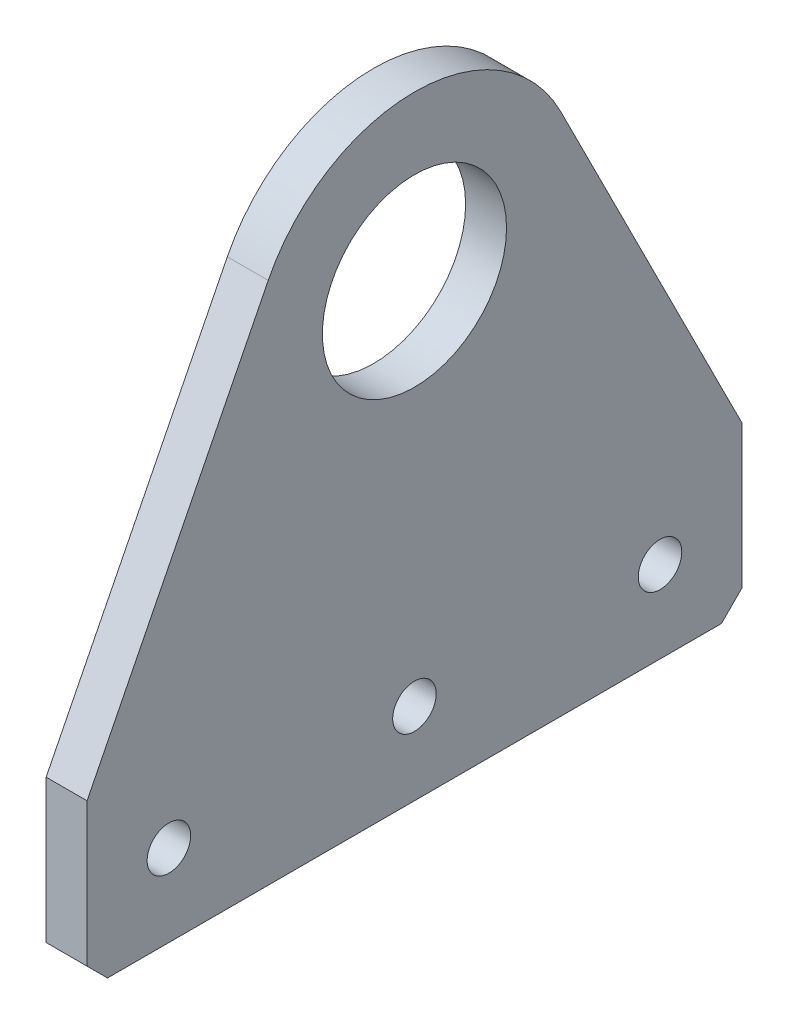
ISO-10303-21;
HEADER;
FILE_DESCRIPTION(('STEP AP214'),'2;1');
FILE_NAME('part.step','',(''),(''),'','','');
FILE_SCHEMA(('AUTOMOTIVE_DESIGN { 1 0 10303 214 1 1 1 1 }'));
ENDSEC;
DATA;
#1=APPLICATION_CONTEXT('core data for automotive mechanical design processes');
#2=APPLICATION_PROTOCOL_DEFINITION('international standard','automotive_design',2000,#1);
#3=PRODUCT_CONTEXT('',#1,'mechanical');
#4=PRODUCT('Part','Part','',(#3));
#5=PRODUCT_RELATED_PRODUCT_CATEGORY('part','',(#4));
#6=PRODUCT_DEFINITION_FORMATION('','',#4);
#7=PRODUCT_DEFINITION_CONTEXT('part definition',#1,'design');
#8=PRODUCT_DEFINITION('design','',#6,#7);
#9=PRODUCT_DEFINITION_SHAPE('','',#8);
#10=(LENGTH_UNIT() NAMED_UNIT(*) SI_UNIT(.MILLI.,.METRE.));
#11=(NAMED_UNIT(*) PLANE_ANGLE_UNIT() SI_UNIT($,.RADIAN.));
#12=(NAMED_UNIT(*) SI_UNIT($,.STERADIAN.) SOLID_ANGLE_UNIT());
#13=UNCERTAINTY_MEASURE_WITH_UNIT(LENGTH_MEASURE(1.E-05),#10,'distance_accuracy_value','');
#14=(GEOMETRIC_REPRESENTATION_CONTEXT(3) GLOBAL_UNCERTAINTY_ASSIGNED_CONTEXT((#13)) GLOBAL_UNIT_ASSIGNED_CONTEXT((#10,
#11,#12)) REPRESENTATION_CONTEXT('',''));
#15=CARTESIAN_POINT('',(0.,0.,0.));
#16=DIRECTION('',(0.,0.,1.));
#17=DIRECTION('',(1.,0.,0.));
#18=AXIS2_PLACEMENT_3D('',#15,#16,#17);
#19=CARTESIAN_POINT('',(6.35,69.85,-50.8));
#20=DIRECTION('',(-1.,0.,0.));
#21=DIRECTION('',(0.,0.,1.));
#22=AXIS2_PLACEMENT_3D('',#19,#20,#21);
#23=PLANE('',#22);
#24=CARTESIAN_POINT('',(6.35,12.7,-12.7));
#25=DIRECTION('',(1.,0.,0.));
#26=DIRECTION('',(0.,0.,-1.));
#27=AXIS2_PLACEMENT_3D('',#24,#25,#26);
#28=CIRCLE('',#27,3.3782);
#29=CARTESIAN_POINT('',(6.35,12.7,-16.0782));
#30=VERTEX_POINT('',#29);
#31=EDGE_CURVE('E306',#30,#30,#28,.T.);
#32=ORIENTED_EDGE('',*,*,#31,.F.);
#33=EDGE_LOOP('',(#32));
#34=FACE_BOUND('',#33,.T.);
#35=CARTESIAN_POINT('',(6.35,12.7,-50.8));
#36=DIRECTION('',(1.,0.,0.));
#37=DIRECTION('',(0.,0.,-1.));
#38=AXIS2_PLACEMENT_3D('',#35,#36,#37);
#39=CIRCLE('',#38,3.3782);
#40=CARTESIAN_POINT('',(6.35,12.7,-54.1782));
#41=VERTEX_POINT('',#40);
#42=EDGE_CURVE('E208',#41,#41,#39,.T.);
#43=ORIENTED_EDGE('',*,*,#42,.F.);
#44=EDGE_LOOP('',(#43));
#45=FACE_BOUND('',#44,.T.);
#46=CARTESIAN_POINT('',(6.35,12.7,-88.9));
#47=DIRECTION('',(1.,0.,0.));
#48=DIRECTION('',(0.,0.,-1.));
#49=AXIS2_PLACEMENT_3D('',#46,#47,#48);
#50=CIRCLE('',#49,3.37819999999999);
#51=CARTESIAN_POINT('',(6.35,12.7,-92.2782));
#52=VERTEX_POINT('',#51);
#53=EDGE_CURVE('E202',#52,#52,#50,.T.);
#54=ORIENTED_EDGE('',*,*,#53,.F.);
#55=EDGE_LOOP('',(#54));
#56=FACE_BOUND('',#55,.T.);
#57=DIRECTION('',(0.,0.,-1.));
#58=VECTOR('',#57,1.);
#59=CARTESIAN_POINT('',(6.35,0.,-101.6));
#60=LINE('',#59,#58);
#61=CARTESIAN_POINT('',(6.35,0.,-3.17500000000001));
#62=VERTEX_POINT('',#61);
#63=CARTESIAN_POINT('',(6.35,0.,-98.425));
#64=VERTEX_POINT('',#63);
#65=EDGE_CURVE('E128',#62,#64,#60,.T.);
#66=ORIENTED_EDGE('',*,*,#65,.T.);
#67=DIRECTION('',(0.,-0.707106781186548,0.707106781186548));
#68=VECTOR('',#67,1.);
#69=CARTESIAN_POINT('',(6.35,3.17500000000001,-101.6));
#70=LINE('',#69,#68);
#71=CARTESIAN_POINT('',(6.35,3.17500000000001,-101.6));
#72=VERTEX_POINT('',#71);
#73=EDGE_CURVE('E59',#64,#72,#70,.F.);
#74=ORIENTED_EDGE('',*,*,#73,.T.);
#75=DIRECTION('',(0.,1.,0.));
#76=VECTOR('',#75,1.);
#77=CARTESIAN_POINT('',(6.35,25.4,-101.6));
#78=LINE('',#77,#76);
#79=CARTESIAN_POINT('',(6.35,25.4,-101.6));
#80=VERTEX_POINT('',#79);
#81=EDGE_CURVE('E117',#72,#80,#78,.T.);
#82=ORIENTED_EDGE('',*,*,#81,.T.);
#83=DIRECTION('',(0.,0.893292076217458,0.449476658534237));
#84=VECTOR('',#83,1.);
#85=CARTESIAN_POINT('',(6.35,81.2667071267696,-73.4896187359234));
#86=LINE('',#85,#84);
#87=CARTESIAN_POINT('',(6.35,81.2667071267696,-73.4896187359234));
#88=VERTEX_POINT('',#87);
#89=EDGE_CURVE('E121',#80,#88,#86,.T.);
#90=ORIENTED_EDGE('',*,*,#89,.T.);
#91=CARTESIAN_POINT('',(6.35,69.85,-50.8));
#92=DIRECTION('',(1.,0.,0.));
#93=DIRECTION('',(0.,0.,1.));
#94=AXIS2_PLACEMENT_3D('',#91,#92,#93);
#95=CIRCLE('',#94,25.4);
#96=CARTESIAN_POINT('',(6.35,81.2667071267696,-28.1103812640766));
#97=VERTEX_POINT('',#96);
#98=EDGE_CURVE('E144',#88,#97,#95,.T.);
#99=ORIENTED_EDGE('',*,*,#98,.T.);
#100=DIRECTION('',(0.,-0.893292076217458,0.449476658534238));
#101=VECTOR('',#100,1.);
#102=CARTESIAN_POINT('',(6.35,25.4,0.));
#103=LINE('',#102,#101);
#104=CARTESIAN_POINT('',(6.35,25.4,0.));
#105=VERTEX_POINT('',#104);
#106=EDGE_CURVE('E148',#97,#105,#103,.T.);
#107=ORIENTED_EDGE('',*,*,#106,.T.);
#108=DIRECTION('',(0.,-1.,0.));
#109=VECTOR('',#108,1.);
#110=CARTESIAN_POINT('',(6.35,0.,0.));
#111=LINE('',#110,#109);
#112=CARTESIAN_POINT('',(6.35,3.17500000000001,0.));
#113=VERTEX_POINT('',#112);
#114=EDGE_CURVE('E154',#105,#113,#111,.T.);
#115=ORIENTED_EDGE('',*,*,#114,.T.);
#116=DIRECTION('',(0.,0.707106781186548,0.707106781186548));
#117=VECTOR('',#116,1.);
#118=CARTESIAN_POINT('',(6.35,0.,-3.17500000000001));
#119=LINE('',#118,#117);
#120=EDGE_CURVE('E186',#113,#62,#119,.F.);
#121=ORIENTED_EDGE('',*,*,#120,.T.);
#122=EDGE_LOOP('',(#66,#74,#82,#90,#99,#107,#115,#121));
#123=FACE_BOUND('',#122,.T.);
#124=CARTESIAN_POINT('',(6.35,69.85,-50.8));
#125=DIRECTION('',(1.,0.,0.));
#126=DIRECTION('',(0.,0.,-1.));
#127=AXIS2_PLACEMENT_3D('',#124,#125,#126);
#128=CIRCLE('',#127,14.2875);
#129=CARTESIAN_POINT('',(6.35,69.85,-65.0875));
#130=VERTEX_POINT('',#129);
#131=EDGE_CURVE('E161',#130,#130,#128,.T.);
#132=ORIENTED_EDGE('',*,*,#131,.F.);
#133=EDGE_LOOP('',(#132));
#134=FACE_BOUND('',#133,.T.);
#135=ADVANCED_FACE('F50',(#34,#45,#56,#123,#134),#23,.F.);
#136=CARTESIAN_POINT('',(0.,69.85,-50.8));
#137=DIRECTION('',(-1.,0.,0.));
#138=DIRECTION('',(0.,0.,1.));
#139=AXIS2_PLACEMENT_3D('',#136,#137,#138);
#140=PLANE('',#139);
#141=CARTESIAN_POINT('',(0.,12.7,-12.7));
#142=DIRECTION('',(1.,0.,0.));
#143=DIRECTION('',(0.,0.,-1.));
#144=AXIS2_PLACEMENT_3D('',#141,#142,#143);
#145=CIRCLE('',#144,3.3782);
#146=CARTESIAN_POINT('',(0.,12.7,-16.0782));
#147=VERTEX_POINT('',#146);
#148=EDGE_CURVE('E197',#147,#147,#145,.T.);
#149=ORIENTED_EDGE('',*,*,#148,.T.);
#150=EDGE_LOOP('',(#149));
#151=FACE_BOUND('',#150,.T.);
#152=CARTESIAN_POINT('',(0.,12.7,-50.8));
#153=DIRECTION('',(1.,0.,0.));
#154=DIRECTION('',(0.,0.,-1.));
#155=AXIS2_PLACEMENT_3D('',#152,#153,#154);
#156=CIRCLE('',#155,3.3782);
#157=CARTESIAN_POINT('',(0.,12.7,-54.1782));
#158=VERTEX_POINT('',#157);
#159=EDGE_CURVE('E213',#158,#158,#156,.T.);
#160=ORIENTED_EDGE('',*,*,#159,.T.);
#161=EDGE_LOOP('',(#160));
#162=FACE_BOUND('',#161,.T.);
#163=CARTESIAN_POINT('',(0.,12.7,-88.9));
#164=DIRECTION('',(1.,0.,0.));
#165=DIRECTION('',(0.,0.,-1.));
#166=AXIS2_PLACEMENT_3D('',#163,#164,#165);
#167=CIRCLE('',#166,3.37819999999999);
#168=CARTESIAN_POINT('',(0.,12.7,-92.2782));
#169=VERTEX_POINT('',#168);
#170=EDGE_CURVE('E214',#169,#169,#167,.T.);
#171=ORIENTED_EDGE('',*,*,#170,.T.);
#172=EDGE_LOOP('',(#171));
#173=FACE_BOUND('',#172,.T.);
#174=DIRECTION('',(0.,1.,0.));
#175=VECTOR('',#174,1.);
#176=CARTESIAN_POINT('',(0.,25.4,-101.6));
#177=LINE('',#176,#175);
#178=CARTESIAN_POINT('',(0.,3.17500000000001,-101.6));
#179=VERTEX_POINT('',#178);
#180=CARTESIAN_POINT('',(0.,25.4,-101.6));
#181=VERTEX_POINT('',#180);
#182=EDGE_CURVE('E134',#179,#181,#177,.T.);
#183=ORIENTED_EDGE('',*,*,#182,.F.);
#184=DIRECTION('',(0.,0.707106781186548,-0.707106781186548));
#185=VECTOR('',#184,1.);
#186=CARTESIAN_POINT('',(0.,11.1125,-109.5375));
#187=LINE('',#186,#185);
#188=CARTESIAN_POINT('',(0.,0.,-98.425));
#189=VERTEX_POINT('',#188);
#190=EDGE_CURVE('E180',#179,#189,#187,.F.);
#191=ORIENTED_EDGE('',*,*,#190,.T.);
#192=DIRECTION('',(0.,0.,-1.));
#193=VECTOR('',#192,1.);
#194=CARTESIAN_POINT('',(0.,0.,-101.6));
#195=LINE('',#194,#193);
#196=CARTESIAN_POINT('',(0.,0.,-3.17500000000001));
#197=VERTEX_POINT('',#196);
#198=EDGE_CURVE('E158',#197,#189,#195,.T.);
#199=ORIENTED_EDGE('',*,*,#198,.F.);
#200=DIRECTION('',(0.,-0.707106781186548,-0.707106781186548));
#201=VECTOR('',#200,1.);
#202=CARTESIAN_POINT('',(0.,11.1125,7.93749999999998));
#203=LINE('',#202,#201);
#204=CARTESIAN_POINT('',(0.,3.17500000000001,0.));
#205=VERTEX_POINT('',#204);
#206=EDGE_CURVE('E178',#197,#205,#203,.F.);
#207=ORIENTED_EDGE('',*,*,#206,.T.);
#208=DIRECTION('',(0.,-1.,0.));
#209=VECTOR('',#208,1.);
#210=CARTESIAN_POINT('',(0.,0.,0.));
#211=LINE('',#210,#209);
#212=CARTESIAN_POINT('',(0.,25.4,0.));
#213=VERTEX_POINT('',#212);
#214=EDGE_CURVE('E169',#213,#205,#211,.T.);
#215=ORIENTED_EDGE('',*,*,#214,.F.);
#216=DIRECTION('',(0.,-0.893292076217458,0.449476658534238));
#217=VECTOR('',#216,1.);
#218=CARTESIAN_POINT('',(0.,25.4,0.));
#219=LINE('',#218,#217);
#220=CARTESIAN_POINT('',(0.,81.2667071267696,-28.1103812640766));
#221=VERTEX_POINT('',#220);
#222=EDGE_CURVE('E167',#221,#213,#219,.T.);
#223=ORIENTED_EDGE('',*,*,#222,.F.);
#224=CARTESIAN_POINT('',(0.,69.85,-50.8));
#225=DIRECTION('',(1.,0.,0.));
#226=DIRECTION('',(0.,0.,1.));
#227=AXIS2_PLACEMENT_3D('',#224,#225,#226);
#228=CIRCLE('',#227,25.4);
#229=CARTESIAN_POINT('',(0.,81.2667071267696,-73.4896187359234));
#230=VERTEX_POINT('',#229);
#231=EDGE_CURVE('E165',#230,#221,#228,.T.);
#232=ORIENTED_EDGE('',*,*,#231,.F.);
#233=DIRECTION('',(0.,0.893292076217458,0.449476658534237));
#234=VECTOR('',#233,1.);
#235=CARTESIAN_POINT('',(0.,81.2667071267696,-73.4896187359234));
#236=LINE('',#235,#234);
#237=EDGE_CURVE('E163',#181,#230,#236,.T.);
#238=ORIENTED_EDGE('',*,*,#237,.F.);
#239=EDGE_LOOP('',(#183,#191,#199,#207,#215,#223,#232,#238));
#240=FACE_BOUND('',#239,.T.);
#241=CARTESIAN_POINT('',(0.,69.85,-50.8));
#242=DIRECTION('',(1.,0.,0.));
#243=DIRECTION('',(0.,0.,-1.));
#244=AXIS2_PLACEMENT_3D('',#241,#242,#243);
#245=CIRCLE('',#244,14.2875);
#246=CARTESIAN_POINT('',(0.,69.85,-65.0875));
#247=VERTEX_POINT('',#246);
#248=EDGE_CURVE('E194',#247,#247,#245,.T.);
#249=ORIENTED_EDGE('',*,*,#248,.T.);
#250=EDGE_LOOP('',(#249));
#251=FACE_BOUND('',#250,.T.);
#252=ADVANCED_FACE('F226',(#151,#162,#173,#240,#251),#140,.T.);
#253=CARTESIAN_POINT('',(6.35,0.,-101.6));
#254=DIRECTION('',(0.,1.,0.));
#255=DIRECTION('',(0.,0.,1.));
#256=AXIS2_PLACEMENT_3D('',#253,#254,#255);
#257=PLANE('',#256);
#258=ORIENTED_EDGE('',*,*,#198,.T.);
#259=DIRECTION('',(1.,0.,0.));
#260=VECTOR('',#259,1.);
#261=CARTESIAN_POINT('',(6.35,0.,-98.425));
#262=LINE('',#261,#260);
#263=EDGE_CURVE('E72',#189,#64,#262,.T.);
#264=ORIENTED_EDGE('',*,*,#263,.T.);
#265=ORIENTED_EDGE('',*,*,#65,.F.);
#266=DIRECTION('',(-1.,0.,0.));
#267=VECTOR('',#266,1.);
#268=CARTESIAN_POINT('',(6.35,0.,-3.17500000000001));
#269=LINE('',#268,#267);
#270=EDGE_CURVE('E182',#62,#197,#269,.T.);
#271=ORIENTED_EDGE('',*,*,#270,.T.);
#272=EDGE_LOOP('',(#258,#264,#265,#271));
#273=FACE_BOUND('',#272,.T.);
#274=ADVANCED_FACE('F232',(#273),#257,.F.);
#275=CARTESIAN_POINT('',(6.35,25.4,-101.6));
#276=DIRECTION('',(0.,0.,1.));
#277=DIRECTION('',(1.,0.,0.));
#278=AXIS2_PLACEMENT_3D('',#275,#276,#277);
#279=PLANE('',#278);
#280=ORIENTED_EDGE('',*,*,#81,.F.);
#281=DIRECTION('',(-1.,0.,0.));
#282=VECTOR('',#281,1.);
#283=CARTESIAN_POINT('',(6.35,3.17500000000001,-101.6));
#284=LINE('',#283,#282);
#285=EDGE_CURVE('E137',#72,#179,#284,.T.);
#286=ORIENTED_EDGE('',*,*,#285,.T.);
#287=ORIENTED_EDGE('',*,*,#182,.T.);
#288=DIRECTION('',(-1.,0.,0.));
#289=VECTOR('',#288,1.);
#290=CARTESIAN_POINT('',(6.35,25.4,-101.6));
#291=LINE('',#290,#289);
#292=EDGE_CURVE('E131',#80,#181,#291,.T.);
#293=ORIENTED_EDGE('',*,*,#292,.F.);
#294=EDGE_LOOP('',(#280,#286,#287,#293));
#295=FACE_BOUND('',#294,.T.);
#296=ADVANCED_FACE('F132',(#295),#279,.F.);
#297=CARTESIAN_POINT('',(6.35,81.2667071267696,-73.4896187359234));
#298=DIRECTION('',(0.,-0.449476658534237,0.893292076217458));
#299=DIRECTION('',(0.,-0.893292076217458,-0.449476658534238));
#300=AXIS2_PLACEMENT_3D('',#297,#298,#299);
#301=PLANE('',#300);
#302=ORIENTED_EDGE('',*,*,#237,.T.);
#303=DIRECTION('',(-1.,0.,0.));
#304=VECTOR('',#303,1.);
#305=CARTESIAN_POINT('',(6.35,81.2667071267696,-73.4896187359234));
#306=LINE('',#305,#304);
#307=EDGE_CURVE('E138',#88,#230,#306,.T.);
#308=ORIENTED_EDGE('',*,*,#307,.F.);
#309=ORIENTED_EDGE('',*,*,#89,.F.);
#310=ORIENTED_EDGE('',*,*,#292,.T.);
#311=EDGE_LOOP('',(#302,#308,#309,#310));
#312=FACE_BOUND('',#311,.T.);
#313=ADVANCED_FACE('F140',(#312),#301,.F.);
#314=CARTESIAN_POINT('',(6.35,69.85,-50.8));
#315=DIRECTION('',(-1.,0.,0.));
#316=DIRECTION('',(0.,0.,1.));
#317=AXIS2_PLACEMENT_3D('',#314,#315,#316);
#318=CYLINDRICAL_SURFACE('',#317,25.4);
#319=ORIENTED_EDGE('',*,*,#231,.T.);
#320=DIRECTION('',(-1.,0.,0.));
#321=VECTOR('',#320,1.);
#322=CARTESIAN_POINT('',(6.35,81.2667071267696,-28.1103812640766));
#323=LINE('',#322,#321);
#324=EDGE_CURVE('E173',#97,#221,#323,.T.);
#325=ORIENTED_EDGE('',*,*,#324,.F.);
#326=ORIENTED_EDGE('',*,*,#98,.F.);
#327=ORIENTED_EDGE('',*,*,#307,.T.);
#328=EDGE_LOOP('',(#319,#325,#326,#327));
#329=FACE_BOUND('',#328,.T.);
#330=ADVANCED_FACE('F248',(#329),#318,.T.);
#331=CARTESIAN_POINT('',(6.35,25.4,0.));
#332=DIRECTION('',(0.,-0.449476658534238,-0.893292076217458));
#333=DIRECTION('',(0.,0.893292076217458,-0.449476658534238));
#334=AXIS2_PLACEMENT_3D('',#331,#332,#333);
#335=PLANE('',#334);
#336=ORIENTED_EDGE('',*,*,#222,.T.);
#337=DIRECTION('',(-1.,0.,0.));
#338=VECTOR('',#337,1.);
#339=CARTESIAN_POINT('',(6.35,25.4,0.));
#340=LINE('',#339,#338);
#341=EDGE_CURVE('E157',#105,#213,#340,.T.);
#342=ORIENTED_EDGE('',*,*,#341,.F.);
#343=ORIENTED_EDGE('',*,*,#106,.F.);
#344=ORIENTED_EDGE('',*,*,#324,.T.);
#345=EDGE_LOOP('',(#336,#342,#343,#344));
#346=FACE_BOUND('',#345,.T.);
#347=ADVANCED_FACE('F245',(#346),#335,.F.);
#348=CARTESIAN_POINT('',(6.35,0.,0.));
#349=DIRECTION('',(0.,0.,-1.));
#350=DIRECTION('',(-1.,0.,0.));
#351=AXIS2_PLACEMENT_3D('',#348,#349,#350);
#352=PLANE('',#351);
#353=ORIENTED_EDGE('',*,*,#214,.T.);
#354=DIRECTION('',(1.,0.,0.));
#355=VECTOR('',#354,1.);
#356=CARTESIAN_POINT('',(6.35,3.17500000000001,0.));
#357=LINE('',#356,#355);
#358=EDGE_CURVE('E12',#205,#113,#357,.T.);
#359=ORIENTED_EDGE('',*,*,#358,.T.);
#360=ORIENTED_EDGE('',*,*,#114,.F.);
#361=ORIENTED_EDGE('',*,*,#341,.T.);
#362=EDGE_LOOP('',(#353,#359,#360,#361));
#363=FACE_BOUND('',#362,.T.);
#364=ADVANCED_FACE('F242',(#363),#352,.F.);
#365=CARTESIAN_POINT('',(6.35,69.85,-50.8));
#366=DIRECTION('',(-1.,0.,0.));
#367=DIRECTION('',(0.,0.,1.));
#368=AXIS2_PLACEMENT_3D('',#365,#366,#367);
#369=CYLINDRICAL_SURFACE('',#368,14.2875);
#370=ORIENTED_EDGE('',*,*,#131,.T.);
#371=EDGE_LOOP('',(#370));
#372=FACE_BOUND('',#371,.T.);
#373=ORIENTED_EDGE('',*,*,#248,.F.);
#374=EDGE_LOOP('',(#373));
#375=FACE_BOUND('',#374,.T.);
#376=ADVANCED_FACE('F239',(#372,#375),#369,.F.);
#377=CARTESIAN_POINT('',(0.,12.7,-88.9));
#378=DIRECTION('',(1.,0.,0.));
#379=DIRECTION('',(0.,0.,-1.));
#380=AXIS2_PLACEMENT_3D('',#377,#378,#379);
#381=CYLINDRICAL_SURFACE('',#380,3.37819999999999);
#382=ORIENTED_EDGE('',*,*,#170,.F.);
#383=EDGE_LOOP('',(#382));
#384=FACE_BOUND('',#383,.T.);
#385=ORIENTED_EDGE('',*,*,#53,.T.);
#386=EDGE_LOOP('',(#385));
#387=FACE_BOUND('',#386,.T.);
#388=ADVANCED_FACE('F223',(#384,#387),#381,.F.);
#389=CARTESIAN_POINT('',(0.,12.7,-50.8));
#390=DIRECTION('',(1.,0.,0.));
#391=DIRECTION('',(0.,0.,-1.));
#392=AXIS2_PLACEMENT_3D('',#389,#390,#391);
#393=CYLINDRICAL_SURFACE('',#392,3.3782);
#394=ORIENTED_EDGE('',*,*,#159,.F.);
#395=EDGE_LOOP('',(#394));
#396=FACE_BOUND('',#395,.T.);
#397=ORIENTED_EDGE('',*,*,#42,.T.);
#398=EDGE_LOOP('',(#397));
#399=FACE_BOUND('',#398,.T.);
#400=ADVANCED_FACE('F270',(#396,#399),#393,.F.);
#401=CARTESIAN_POINT('',(0.,12.7,-12.7));
#402=DIRECTION('',(1.,0.,0.));
#403=DIRECTION('',(0.,0.,-1.));
#404=AXIS2_PLACEMENT_3D('',#401,#402,#403);
#405=CYLINDRICAL_SURFACE('',#404,3.3782);
#406=ORIENTED_EDGE('',*,*,#148,.F.);
#407=EDGE_LOOP('',(#406));
#408=FACE_BOUND('',#407,.T.);
#409=ORIENTED_EDGE('',*,*,#31,.T.);
#410=EDGE_LOOP('',(#409));
#411=FACE_BOUND('',#410,.T.);
#412=ADVANCED_FACE('F263',(#408,#411),#405,.F.);
#413=CARTESIAN_POINT('',(6.35,3.17500000000001,-101.6));
#414=DIRECTION('',(0.,0.707106781186548,0.707106781186548));
#415=DIRECTION('',(-1.,0.,0.));
#416=AXIS2_PLACEMENT_3D('',#413,#414,#415);
#417=PLANE('',#416);
#418=ORIENTED_EDGE('',*,*,#73,.F.);
#419=ORIENTED_EDGE('',*,*,#263,.F.);
#420=ORIENTED_EDGE('',*,*,#190,.F.);
#421=ORIENTED_EDGE('',*,*,#285,.F.);
#422=EDGE_LOOP('',(#418,#419,#420,#421));
#423=FACE_BOUND('',#422,.T.);
#424=ADVANCED_FACE('F259',(#423),#417,.F.);
#425=CARTESIAN_POINT('',(6.35,0.,-3.17500000000001));
#426=DIRECTION('',(0.,0.707106781186548,-0.707106781186548));
#427=DIRECTION('',(-1.,0.,0.));
#428=AXIS2_PLACEMENT_3D('',#425,#426,#427);
#429=PLANE('',#428);
#430=ORIENTED_EDGE('',*,*,#120,.F.);
#431=ORIENTED_EDGE('',*,*,#358,.F.);
#432=ORIENTED_EDGE('',*,*,#206,.F.);
#433=ORIENTED_EDGE('',*,*,#270,.F.);
#434=EDGE_LOOP('',(#430,#431,#432,#433));
#435=FACE_BOUND('',#434,.T.);
#436=ADVANCED_FACE('F53',(#435),#429,.F.);
#437=CLOSED_SHELL('',(#135,#252,#274,#296,#313,#330,#347,#364,#376,#388,#400,#412,#424,#436));
#438=MANIFOLD_SOLID_BREP('B2',#437);
#439=ADVANCED_BREP_SHAPE_REPRESENTATION('',(#18,#438),#14);
#440=SHAPE_DEFINITION_REPRESENTATION(#9,#439);
ENDSEC;
END-ISO-10303-21;
